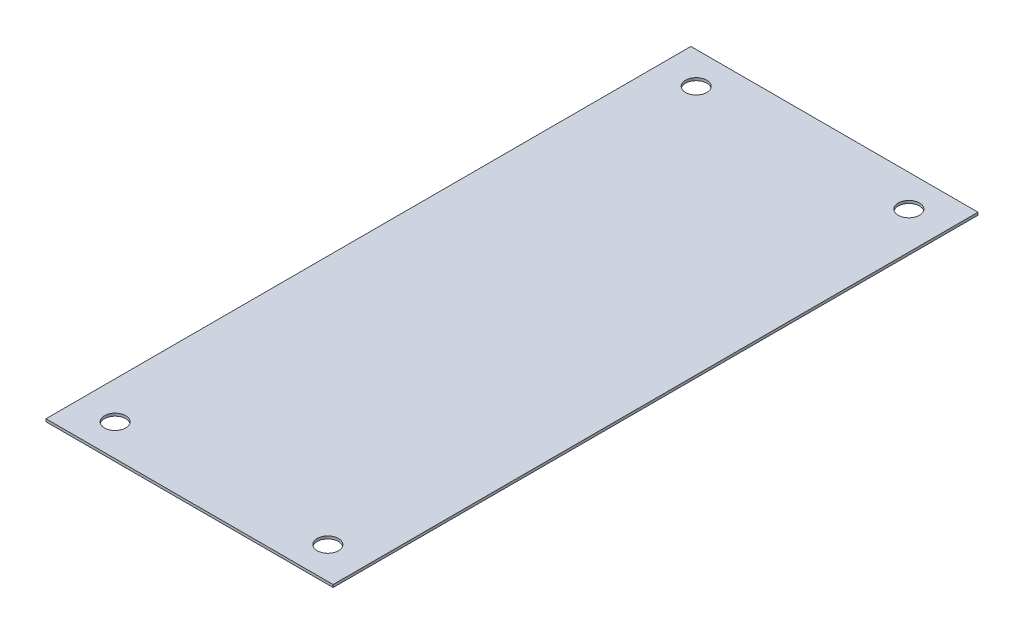
ISO-10303-21;
HEADER;
FILE_DESCRIPTION(('STEP AP214'),'2;1');
FILE_NAME('part.step','',(''),(''),'','','');
FILE_SCHEMA(('AUTOMOTIVE_DESIGN { 1 0 10303 214 1 1 1 1 }'));
ENDSEC;
DATA;
#1=APPLICATION_CONTEXT('core data for automotive mechanical design processes');
#2=APPLICATION_PROTOCOL_DEFINITION('international standard','automotive_design',2000,#1);
#3=PRODUCT_CONTEXT('',#1,'mechanical');
#4=PRODUCT('Part','Part','',(#3));
#5=PRODUCT_RELATED_PRODUCT_CATEGORY('part','',(#4));
#6=PRODUCT_DEFINITION_FORMATION('','',#4);
#7=PRODUCT_DEFINITION_CONTEXT('part definition',#1,'design');
#8=PRODUCT_DEFINITION('design','',#6,#7);
#9=PRODUCT_DEFINITION_SHAPE('','',#8);
#10=(LENGTH_UNIT() NAMED_UNIT(*) SI_UNIT(.MILLI.,.METRE.));
#11=(NAMED_UNIT(*) PLANE_ANGLE_UNIT() SI_UNIT($,.RADIAN.));
#12=(NAMED_UNIT(*) SI_UNIT($,.STERADIAN.) SOLID_ANGLE_UNIT());
#13=UNCERTAINTY_MEASURE_WITH_UNIT(LENGTH_MEASURE(1.E-05),#10,'distance_accuracy_value','');
#14=(GEOMETRIC_REPRESENTATION_CONTEXT(3) GLOBAL_UNCERTAINTY_ASSIGNED_CONTEXT((#13)) GLOBAL_UNIT_ASSIGNED_CONTEXT((#10,
#11,#12)) REPRESENTATION_CONTEXT('',''));
#15=CARTESIAN_POINT('',(0.,0.,0.));
#16=DIRECTION('',(0.,0.,1.));
#17=DIRECTION('',(1.,0.,0.));
#18=AXIS2_PLACEMENT_3D('',#15,#16,#17);
#19=CARTESIAN_POINT('',(0.,3.175,0.));
#20=DIRECTION('',(1.,0.,0.));
#21=DIRECTION('',(0.,0.,-1.));
#22=AXIS2_PLACEMENT_3D('',#19,#20,#21);
#23=PLANE('',#22);
#24=DIRECTION('',(0.,0.,1.));
#25=VECTOR('',#24,1.);
#26=CARTESIAN_POINT('',(0.,0.,0.));
#27=LINE('',#26,#25);
#28=CARTESIAN_POINT('',(0.,0.,-770.128));
#29=VERTEX_POINT('',#28);
#30=CARTESIAN_POINT('',(0.,0.,0.));
#31=VERTEX_POINT('',#30);
#32=EDGE_CURVE('E101',#29,#31,#27,.T.);
#33=ORIENTED_EDGE('',*,*,#32,.T.);
#34=DIRECTION('',(0.,-1.,0.));
#35=VECTOR('',#34,1.);
#36=CARTESIAN_POINT('',(0.,3.175,0.));
#37=LINE('',#36,#35);
#38=CARTESIAN_POINT('',(0.,3.175,0.));
#39=VERTEX_POINT('',#38);
#40=EDGE_CURVE('E11',#39,#31,#37,.T.);
#41=ORIENTED_EDGE('',*,*,#40,.F.);
#42=DIRECTION('',(0.,0.,1.));
#43=VECTOR('',#42,1.);
#44=CARTESIAN_POINT('',(0.,3.175,0.));
#45=LINE('',#44,#43);
#46=CARTESIAN_POINT('',(0.,3.175,-770.128));
#47=VERTEX_POINT('',#46);
#48=EDGE_CURVE('E88',#47,#39,#45,.T.);
#49=ORIENTED_EDGE('',*,*,#48,.F.);
#50=DIRECTION('',(0.,-1.,0.));
#51=VECTOR('',#50,1.);
#52=CARTESIAN_POINT('',(0.,3.175,-770.128));
#53=LINE('',#52,#51);
#54=EDGE_CURVE('E97',#47,#29,#53,.T.);
#55=ORIENTED_EDGE('',*,*,#54,.T.);
#56=EDGE_LOOP('',(#33,#41,#49,#55));
#57=FACE_BOUND('',#56,.T.);
#58=ADVANCED_FACE('F35',(#57),#23,.F.);
#59=CARTESIAN_POINT('',(0.,3.175,0.));
#60=DIRECTION('',(0.,0.,-1.));
#61=DIRECTION('',(-1.,0.,0.));
#62=AXIS2_PLACEMENT_3D('',#59,#60,#61);
#63=PLANE('',#62);
#64=DIRECTION('',(1.,0.,0.));
#65=VECTOR('',#64,1.);
#66=CARTESIAN_POINT('',(0.,0.,0.));
#67=LINE('',#66,#65);
#68=CARTESIAN_POINT('',(342.9,0.,0.));
#69=VERTEX_POINT('',#68);
#70=EDGE_CURVE('E92',#31,#69,#67,.T.);
#71=ORIENTED_EDGE('',*,*,#70,.T.);
#72=DIRECTION('',(0.,-1.,0.));
#73=VECTOR('',#72,1.);
#74=CARTESIAN_POINT('',(342.9,3.175,0.));
#75=LINE('',#74,#73);
#76=CARTESIAN_POINT('',(342.9,3.175,0.));
#77=VERTEX_POINT('',#76);
#78=EDGE_CURVE('E44',#77,#69,#75,.T.);
#79=ORIENTED_EDGE('',*,*,#78,.F.);
#80=DIRECTION('',(1.,0.,0.));
#81=VECTOR('',#80,1.);
#82=CARTESIAN_POINT('',(0.,3.175,0.));
#83=LINE('',#82,#81);
#84=EDGE_CURVE('E83',#39,#77,#83,.T.);
#85=ORIENTED_EDGE('',*,*,#84,.F.);
#86=ORIENTED_EDGE('',*,*,#40,.T.);
#87=EDGE_LOOP('',(#71,#79,#85,#86));
#88=FACE_BOUND('',#87,.T.);
#89=ADVANCED_FACE('F91',(#88),#63,.F.);
#90=CARTESIAN_POINT('',(342.9,3.175,0.));
#91=DIRECTION('',(-1.,0.,0.));
#92=DIRECTION('',(0.,0.,1.));
#93=AXIS2_PLACEMENT_3D('',#90,#91,#92);
#94=PLANE('',#93);
#95=DIRECTION('',(0.,0.,-1.));
#96=VECTOR('',#95,1.);
#97=CARTESIAN_POINT('',(342.9,0.,0.));
#98=LINE('',#97,#96);
#99=CARTESIAN_POINT('',(342.9,0.,-770.128));
#100=VERTEX_POINT('',#99);
#101=EDGE_CURVE('E70',#69,#100,#98,.T.);
#102=ORIENTED_EDGE('',*,*,#101,.T.);
#103=DIRECTION('',(0.,-1.,0.));
#104=VECTOR('',#103,1.);
#105=CARTESIAN_POINT('',(342.9,3.175,-770.128));
#106=LINE('',#105,#104);
#107=CARTESIAN_POINT('',(342.9,3.175,-770.128));
#108=VERTEX_POINT('',#107);
#109=EDGE_CURVE('E93',#108,#100,#106,.T.);
#110=ORIENTED_EDGE('',*,*,#109,.F.);
#111=DIRECTION('',(0.,0.,-1.));
#112=VECTOR('',#111,1.);
#113=CARTESIAN_POINT('',(342.9,3.175,0.));
#114=LINE('',#113,#112);
#115=EDGE_CURVE('E86',#77,#108,#114,.T.);
#116=ORIENTED_EDGE('',*,*,#115,.F.);
#117=ORIENTED_EDGE('',*,*,#78,.T.);
#118=EDGE_LOOP('',(#102,#110,#116,#117));
#119=FACE_BOUND('',#118,.T.);
#120=ADVANCED_FACE('F95',(#119),#94,.F.);
#121=CARTESIAN_POINT('',(0.,3.175,-770.128));
#122=DIRECTION('',(0.,0.,1.));
#123=DIRECTION('',(1.,0.,0.));
#124=AXIS2_PLACEMENT_3D('',#121,#122,#123);
#125=PLANE('',#124);
#126=DIRECTION('',(-1.,0.,0.));
#127=VECTOR('',#126,1.);
#128=CARTESIAN_POINT('',(0.,0.,-770.128));
#129=LINE('',#128,#127);
#130=EDGE_CURVE('E76',#100,#29,#129,.T.);
#131=ORIENTED_EDGE('',*,*,#130,.T.);
#132=ORIENTED_EDGE('',*,*,#54,.F.);
#133=DIRECTION('',(-1.,0.,0.));
#134=VECTOR('',#133,1.);
#135=CARTESIAN_POINT('',(0.,3.175,-770.128));
#136=LINE('',#135,#134);
#137=EDGE_CURVE('E53',#108,#47,#136,.T.);
#138=ORIENTED_EDGE('',*,*,#137,.F.);
#139=ORIENTED_EDGE('',*,*,#109,.T.);
#140=EDGE_LOOP('',(#131,#132,#138,#139));
#141=FACE_BOUND('',#140,.T.);
#142=ADVANCED_FACE('F144',(#141),#125,.F.);
#143=CARTESIAN_POINT('',(0.,3.175,-770.128));
#144=DIRECTION('',(0.,-1.,0.));
#145=DIRECTION('',(0.,0.,-1.));
#146=AXIS2_PLACEMENT_3D('',#143,#144,#145);
#147=PLANE('',#146);
#148=CARTESIAN_POINT('',(44.45,3.175,-38.1));
#149=DIRECTION('',(0.,1.,0.));
#150=DIRECTION('',(0.,0.,1.));
#151=AXIS2_PLACEMENT_3D('',#148,#149,#150);
#152=CIRCLE('',#151,12.7);
#153=CARTESIAN_POINT('',(44.45,3.175,-25.4));
#154=VERTEX_POINT('',#153);
#155=EDGE_CURVE('E126',#154,#154,#152,.T.);
#156=ORIENTED_EDGE('',*,*,#155,.F.);
#157=EDGE_LOOP('',(#156));
#158=FACE_BOUND('',#157,.T.);
#159=CARTESIAN_POINT('',(44.4499999999999,3.175,-732.028));
#160=DIRECTION('',(0.,1.,0.));
#161=DIRECTION('',(0.,0.,1.));
#162=AXIS2_PLACEMENT_3D('',#159,#160,#161);
#163=CIRCLE('',#162,12.7);
#164=CARTESIAN_POINT('',(44.4499999999999,3.175,-719.328));
#165=VERTEX_POINT('',#164);
#166=EDGE_CURVE('E116',#165,#165,#163,.T.);
#167=ORIENTED_EDGE('',*,*,#166,.F.);
#168=EDGE_LOOP('',(#167));
#169=FACE_BOUND('',#168,.T.);
#170=CARTESIAN_POINT('',(298.45,3.175,-732.028));
#171=DIRECTION('',(0.,1.,0.));
#172=DIRECTION('',(0.,0.,1.));
#173=AXIS2_PLACEMENT_3D('',#170,#171,#172);
#174=CIRCLE('',#173,12.7);
#175=CARTESIAN_POINT('',(298.45,3.175,-719.328));
#176=VERTEX_POINT('',#175);
#177=EDGE_CURVE('E113',#176,#176,#174,.T.);
#178=ORIENTED_EDGE('',*,*,#177,.F.);
#179=EDGE_LOOP('',(#178));
#180=FACE_BOUND('',#179,.T.);
#181=CARTESIAN_POINT('',(298.45,3.175,-38.1000000000001));
#182=DIRECTION('',(0.,1.,0.));
#183=DIRECTION('',(0.,0.,1.));
#184=AXIS2_PLACEMENT_3D('',#181,#182,#183);
#185=CIRCLE('',#184,12.7);
#186=CARTESIAN_POINT('',(298.45,3.175,-25.4000000000001));
#187=VERTEX_POINT('',#186);
#188=EDGE_CURVE('E112',#187,#187,#185,.T.);
#189=ORIENTED_EDGE('',*,*,#188,.F.);
#190=EDGE_LOOP('',(#189));
#191=FACE_BOUND('',#190,.T.);
#192=ORIENTED_EDGE('',*,*,#48,.T.);
#193=ORIENTED_EDGE('',*,*,#84,.T.);
#194=ORIENTED_EDGE('',*,*,#115,.T.);
#195=ORIENTED_EDGE('',*,*,#137,.T.);
#196=EDGE_LOOP('',(#192,#193,#194,#195));
#197=FACE_BOUND('',#196,.T.);
#198=ADVANCED_FACE('F84',(#158,#169,#180,#191,#197),#147,.F.);
#199=CARTESIAN_POINT('',(0.,0.,-770.128));
#200=DIRECTION('',(0.,-1.,0.));
#201=DIRECTION('',(0.,0.,-1.));
#202=AXIS2_PLACEMENT_3D('',#199,#200,#201);
#203=PLANE('',#202);
#204=CARTESIAN_POINT('',(44.45,0.,-38.1));
#205=DIRECTION('',(0.,-1.,0.));
#206=DIRECTION('',(0.,0.,-1.));
#207=AXIS2_PLACEMENT_3D('',#204,#205,#206);
#208=CIRCLE('',#207,12.7);
#209=CARTESIAN_POINT('',(44.45,0.,-50.8));
#210=VERTEX_POINT('',#209);
#211=EDGE_CURVE('E38',#210,#210,#208,.T.);
#212=ORIENTED_EDGE('',*,*,#211,.F.);
#213=EDGE_LOOP('',(#212));
#214=FACE_BOUND('',#213,.T.);
#215=CARTESIAN_POINT('',(44.4499999999999,0.,-732.028));
#216=DIRECTION('',(0.,-1.,0.));
#217=DIRECTION('',(0.,0.,-1.));
#218=AXIS2_PLACEMENT_3D('',#215,#216,#217);
#219=CIRCLE('',#218,12.7);
#220=CARTESIAN_POINT('',(44.4499999999999,0.,-744.728));
#221=VERTEX_POINT('',#220);
#222=EDGE_CURVE('E114',#221,#221,#219,.T.);
#223=ORIENTED_EDGE('',*,*,#222,.F.);
#224=EDGE_LOOP('',(#223));
#225=FACE_BOUND('',#224,.T.);
#226=CARTESIAN_POINT('',(298.45,0.,-732.028));
#227=DIRECTION('',(0.,-1.,0.));
#228=DIRECTION('',(0.,0.,-1.));
#229=AXIS2_PLACEMENT_3D('',#226,#227,#228);
#230=CIRCLE('',#229,12.7);
#231=CARTESIAN_POINT('',(298.45,0.,-744.728));
#232=VERTEX_POINT('',#231);
#233=EDGE_CURVE('E110',#232,#232,#230,.T.);
#234=ORIENTED_EDGE('',*,*,#233,.F.);
#235=EDGE_LOOP('',(#234));
#236=FACE_BOUND('',#235,.T.);
#237=CARTESIAN_POINT('',(298.45,0.,-38.1000000000001));
#238=DIRECTION('',(0.,-1.,0.));
#239=DIRECTION('',(0.,0.,-1.));
#240=AXIS2_PLACEMENT_3D('',#237,#238,#239);
#241=CIRCLE('',#240,12.7);
#242=CARTESIAN_POINT('',(298.45,0.,-50.8));
#243=VERTEX_POINT('',#242);
#244=EDGE_CURVE('E104',#243,#243,#241,.T.);
#245=ORIENTED_EDGE('',*,*,#244,.F.);
#246=EDGE_LOOP('',(#245));
#247=FACE_BOUND('',#246,.T.);
#248=ORIENTED_EDGE('',*,*,#32,.F.);
#249=ORIENTED_EDGE('',*,*,#130,.F.);
#250=ORIENTED_EDGE('',*,*,#101,.F.);
#251=ORIENTED_EDGE('',*,*,#70,.F.);
#252=EDGE_LOOP('',(#248,#249,#250,#251));
#253=FACE_BOUND('',#252,.T.);
#254=ADVANCED_FACE('F137',(#214,#225,#236,#247,#253),#203,.T.);
#255=CARTESIAN_POINT('',(298.45,3.175,-38.1000000000001));
#256=DIRECTION('',(0.,1.,0.));
#257=DIRECTION('',(0.,0.,1.));
#258=AXIS2_PLACEMENT_3D('',#255,#256,#257);
#259=CYLINDRICAL_SURFACE('',#258,12.7);
#260=ORIENTED_EDGE('',*,*,#244,.T.);
#261=EDGE_LOOP('',(#260));
#262=FACE_BOUND('',#261,.T.);
#263=ORIENTED_EDGE('',*,*,#188,.T.);
#264=EDGE_LOOP('',(#263));
#265=FACE_BOUND('',#264,.T.);
#266=ADVANCED_FACE('F134',(#262,#265),#259,.F.);
#267=CARTESIAN_POINT('',(298.45,3.175,-732.028));
#268=DIRECTION('',(0.,1.,0.));
#269=DIRECTION('',(0.,0.,1.));
#270=AXIS2_PLACEMENT_3D('',#267,#268,#269);
#271=CYLINDRICAL_SURFACE('',#270,12.7);
#272=ORIENTED_EDGE('',*,*,#233,.T.);
#273=EDGE_LOOP('',(#272));
#274=FACE_BOUND('',#273,.T.);
#275=ORIENTED_EDGE('',*,*,#177,.T.);
#276=EDGE_LOOP('',(#275));
#277=FACE_BOUND('',#276,.T.);
#278=ADVANCED_FACE('F189',(#274,#277),#271,.F.);
#279=CARTESIAN_POINT('',(44.4499999999999,3.175,-732.028));
#280=DIRECTION('',(0.,1.,0.));
#281=DIRECTION('',(0.,0.,1.));
#282=AXIS2_PLACEMENT_3D('',#279,#280,#281);
#283=CYLINDRICAL_SURFACE('',#282,12.7);
#284=ORIENTED_EDGE('',*,*,#222,.T.);
#285=EDGE_LOOP('',(#284));
#286=FACE_BOUND('',#285,.T.);
#287=ORIENTED_EDGE('',*,*,#166,.T.);
#288=EDGE_LOOP('',(#287));
#289=FACE_BOUND('',#288,.T.);
#290=ADVANCED_FACE('F198',(#286,#289),#283,.F.);
#291=CARTESIAN_POINT('',(44.45,3.175,-38.1));
#292=DIRECTION('',(0.,1.,0.));
#293=DIRECTION('',(0.,0.,1.));
#294=AXIS2_PLACEMENT_3D('',#291,#292,#293);
#295=CYLINDRICAL_SURFACE('',#294,12.7);
#296=ORIENTED_EDGE('',*,*,#211,.T.);
#297=EDGE_LOOP('',(#296));
#298=FACE_BOUND('',#297,.T.);
#299=ORIENTED_EDGE('',*,*,#155,.T.);
#300=EDGE_LOOP('',(#299));
#301=FACE_BOUND('',#300,.T.);
#302=ADVANCED_FACE('F208',(#298,#301),#295,.F.);
#303=CLOSED_SHELL('',(#58,#89,#120,#142,#198,#254,#266,#278,#290,#302));
#304=MANIFOLD_SOLID_BREP('B2',#303);
#305=ADVANCED_BREP_SHAPE_REPRESENTATION('',(#18,#304),#14);
#306=SHAPE_DEFINITION_REPRESENTATION(#9,#305);
ENDSEC;
END-ISO-10303-21;
